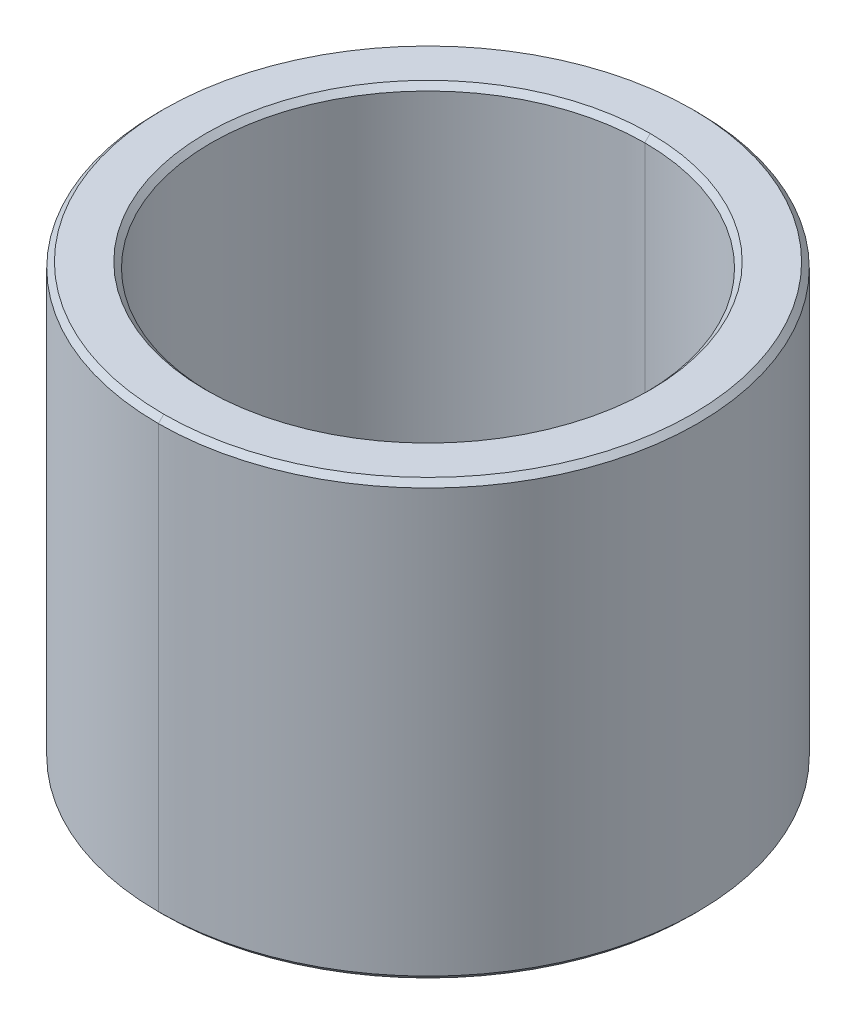
ISO-10303-21;
HEADER;
FILE_DESCRIPTION(('STEP AP214'),'2;1');
FILE_NAME('part.step','',(''),(''),'','','');
FILE_SCHEMA(('AUTOMOTIVE_DESIGN { 1 0 10303 214 1 1 1 1 }'));
ENDSEC;
DATA;
#1=APPLICATION_CONTEXT('core data for automotive mechanical design processes');
#2=APPLICATION_PROTOCOL_DEFINITION('international standard','automotive_design',2000,#1);
#3=PRODUCT_CONTEXT('',#1,'mechanical');
#4=PRODUCT('Part','Part','',(#3));
#5=PRODUCT_RELATED_PRODUCT_CATEGORY('part','',(#4));
#6=PRODUCT_DEFINITION_FORMATION('','',#4);
#7=PRODUCT_DEFINITION_CONTEXT('part definition',#1,'design');
#8=PRODUCT_DEFINITION('design','',#6,#7);
#9=PRODUCT_DEFINITION_SHAPE('','',#8);
#10=(LENGTH_UNIT() NAMED_UNIT(*) SI_UNIT(.MILLI.,.METRE.));
#11=(NAMED_UNIT(*) PLANE_ANGLE_UNIT() SI_UNIT($,.RADIAN.));
#12=(NAMED_UNIT(*) SI_UNIT($,.STERADIAN.) SOLID_ANGLE_UNIT());
#13=UNCERTAINTY_MEASURE_WITH_UNIT(LENGTH_MEASURE(1.E-05),#10,'distance_accuracy_value','');
#14=(GEOMETRIC_REPRESENTATION_CONTEXT(3) GLOBAL_UNCERTAINTY_ASSIGNED_CONTEXT((#13)) GLOBAL_UNIT_ASSIGNED_CONTEXT((#10,
#11,#12)) REPRESENTATION_CONTEXT('',''));
#15=CARTESIAN_POINT('',(0.,0.,0.));
#16=DIRECTION('',(0.,0.,1.));
#17=DIRECTION('',(1.,0.,0.));
#18=AXIS2_PLACEMENT_3D('',#15,#16,#17);
#19=CARTESIAN_POINT('',(0.,3.9,0.));
#20=DIRECTION('',(0.,1.,0.));
#21=DIRECTION('',(0.,0.,1.));
#22=AXIS2_PLACEMENT_3D('',#19,#20,#21);
#23=CONICAL_SURFACE('',#22,4.,0.785398163397448);
#24=DIRECTION('',(0.,0.707106781186548,-0.707106781186548));
#25=VECTOR('',#24,1.);
#26=CARTESIAN_POINT('',(0.,3.9,-4.));
#27=LINE('',#26,#25);
#28=CARTESIAN_POINT('',(0.,3.9,-4.));
#29=VERTEX_POINT('',#28);
#30=CARTESIAN_POINT('',(0.,4.,-4.1));
#31=VERTEX_POINT('',#30);
#32=EDGE_CURVE('E200',#29,#31,#27,.T.);
#33=ORIENTED_EDGE('',*,*,#32,.F.);
#34=CARTESIAN_POINT('',(0.,3.9,0.));
#35=DIRECTION('',(0.,1.,0.));
#36=DIRECTION('',(0.,0.,1.));
#37=AXIS2_PLACEMENT_3D('',#34,#35,#36);
#38=CIRCLE('',#37,4.);
#39=CARTESIAN_POINT('',(0.,3.9,4.));
#40=VERTEX_POINT('',#39);
#41=EDGE_CURVE('E24',#40,#29,#38,.T.);
#42=ORIENTED_EDGE('',*,*,#41,.F.);
#43=DIRECTION('',(0.,0.707106781186548,0.707106781186548));
#44=VECTOR('',#43,1.);
#45=CARTESIAN_POINT('',(0.,3.9,4.));
#46=LINE('',#45,#44);
#47=CARTESIAN_POINT('',(0.,4.,4.1));
#48=VERTEX_POINT('',#47);
#49=EDGE_CURVE('E210',#40,#48,#46,.T.);
#50=ORIENTED_EDGE('',*,*,#49,.T.);
#51=CARTESIAN_POINT('',(0.,4.,0.));
#52=DIRECTION('',(0.,-1.,0.));
#53=DIRECTION('',(0.,0.,1.));
#54=AXIS2_PLACEMENT_3D('',#51,#52,#53);
#55=CIRCLE('',#54,4.1);
#56=EDGE_CURVE('E173',#31,#48,#55,.T.);
#57=ORIENTED_EDGE('',*,*,#56,.F.);
#58=EDGE_LOOP('',(#33,#42,#50,#57));
#59=FACE_BOUND('',#58,.T.);
#60=ADVANCED_FACE('F16',(#59),#23,.F.);
#61=CARTESIAN_POINT('',(0.,-4.,0.));
#62=DIRECTION('',(0.,-1.,0.));
#63=DIRECTION('',(0.,0.,-1.));
#64=AXIS2_PLACEMENT_3D('',#61,#62,#63);
#65=CONICAL_SURFACE('',#64,4.1,0.785398163397448);
#66=DIRECTION('',(0.,-0.707106781186548,0.707106781186548));
#67=VECTOR('',#66,1.);
#68=CARTESIAN_POINT('',(0.,-4.,4.1));
#69=LINE('',#68,#67);
#70=CARTESIAN_POINT('',(0.,-3.9,4.));
#71=VERTEX_POINT('',#70);
#72=CARTESIAN_POINT('',(0.,-4.,4.1));
#73=VERTEX_POINT('',#72);
#74=EDGE_CURVE('E128',#71,#73,#69,.T.);
#75=ORIENTED_EDGE('',*,*,#74,.F.);
#76=CARTESIAN_POINT('',(0.,-3.9,0.));
#77=DIRECTION('',(0.,-1.,0.));
#78=DIRECTION('',(0.,0.,1.));
#79=AXIS2_PLACEMENT_3D('',#76,#77,#78);
#80=CIRCLE('',#79,4.);
#81=CARTESIAN_POINT('',(0.,-3.9,-4.));
#82=VERTEX_POINT('',#81);
#83=EDGE_CURVE('E10',#82,#71,#80,.T.);
#84=ORIENTED_EDGE('',*,*,#83,.F.);
#85=DIRECTION('',(0.,-0.707106781186548,-0.707106781186548));
#86=VECTOR('',#85,1.);
#87=CARTESIAN_POINT('',(0.,-4.,-4.1));
#88=LINE('',#87,#86);
#89=CARTESIAN_POINT('',(0.,-4.,-4.1));
#90=VERTEX_POINT('',#89);
#91=EDGE_CURVE('E118',#82,#90,#88,.T.);
#92=ORIENTED_EDGE('',*,*,#91,.T.);
#93=CARTESIAN_POINT('',(0.,-4.,0.));
#94=DIRECTION('',(0.,1.,0.));
#95=DIRECTION('',(0.,0.,1.));
#96=AXIS2_PLACEMENT_3D('',#93,#94,#95);
#97=CIRCLE('',#96,4.1);
#98=EDGE_CURVE('E104',#73,#90,#97,.T.);
#99=ORIENTED_EDGE('',*,*,#98,.F.);
#100=EDGE_LOOP('',(#75,#84,#92,#99));
#101=FACE_BOUND('',#100,.T.);
#102=ADVANCED_FACE('F119',(#101),#65,.F.);
#103=CARTESIAN_POINT('',(0.,4.,0.));
#104=DIRECTION('',(0.,-1.,0.));
#105=DIRECTION('',(0.,0.,-1.));
#106=AXIS2_PLACEMENT_3D('',#103,#104,#105);
#107=CONICAL_SURFACE('',#106,4.875,0.785398163397462);
#108=DIRECTION('',(0.,-0.707106781186538,0.707106781186557));
#109=VECTOR('',#108,1.);
#110=CARTESIAN_POINT('',(0.,4.,4.875));
#111=LINE('',#110,#109);
#112=CARTESIAN_POINT('',(0.,4.,4.875));
#113=VERTEX_POINT('',#112);
#114=CARTESIAN_POINT('',(0.,3.9,4.975));
#115=VERTEX_POINT('',#114);
#116=EDGE_CURVE('E154',#113,#115,#111,.T.);
#117=ORIENTED_EDGE('',*,*,#116,.F.);
#118=CARTESIAN_POINT('',(0.,4.,0.));
#119=DIRECTION('',(0.,1.,0.));
#120=DIRECTION('',(0.,0.,1.));
#121=AXIS2_PLACEMENT_3D('',#118,#119,#120);
#122=CIRCLE('',#121,4.875);
#123=CARTESIAN_POINT('',(0.,4.,-4.875));
#124=VERTEX_POINT('',#123);
#125=EDGE_CURVE('E170',#124,#113,#122,.T.);
#126=ORIENTED_EDGE('',*,*,#125,.F.);
#127=DIRECTION('',(0.,-0.707106781186538,-0.707106781186557));
#128=VECTOR('',#127,1.);
#129=CARTESIAN_POINT('',(0.,4.,-4.875));
#130=LINE('',#129,#128);
#131=CARTESIAN_POINT('',(0.,3.9,-4.975));
#132=VERTEX_POINT('',#131);
#133=EDGE_CURVE('E150',#124,#132,#130,.T.);
#134=ORIENTED_EDGE('',*,*,#133,.T.);
#135=CARTESIAN_POINT('',(0.,3.9,0.));
#136=DIRECTION('',(0.,-1.,0.));
#137=DIRECTION('',(0.,0.,1.));
#138=AXIS2_PLACEMENT_3D('',#135,#136,#137);
#139=CIRCLE('',#138,4.975);
#140=EDGE_CURVE('E114',#115,#132,#139,.T.);
#141=ORIENTED_EDGE('',*,*,#140,.F.);
#142=EDGE_LOOP('',(#117,#126,#134,#141));
#143=FACE_BOUND('',#142,.T.);
#144=ADVANCED_FACE('F237',(#143),#107,.T.);
#145=CARTESIAN_POINT('',(0.,-3.9,0.));
#146=DIRECTION('',(0.,1.,0.));
#147=DIRECTION('',(0.,0.,1.));
#148=AXIS2_PLACEMENT_3D('',#145,#146,#147);
#149=CONICAL_SURFACE('',#148,4.975,0.785398163397448);
#150=DIRECTION('',(0.,0.707106781186548,-0.707106781186548));
#151=VECTOR('',#150,1.);
#152=CARTESIAN_POINT('',(0.,-3.9,-4.975));
#153=LINE('',#152,#151);
#154=CARTESIAN_POINT('',(0.,-4.,-4.875));
#155=VERTEX_POINT('',#154);
#156=CARTESIAN_POINT('',(0.,-3.9,-4.975));
#157=VERTEX_POINT('',#156);
#158=EDGE_CURVE('E144',#155,#157,#153,.T.);
#159=ORIENTED_EDGE('',*,*,#158,.F.);
#160=CARTESIAN_POINT('',(0.,-4.,0.));
#161=DIRECTION('',(0.,-1.,0.));
#162=DIRECTION('',(0.,0.,1.));
#163=AXIS2_PLACEMENT_3D('',#160,#161,#162);
#164=CIRCLE('',#163,4.875);
#165=CARTESIAN_POINT('',(0.,-4.,4.875));
#166=VERTEX_POINT('',#165);
#167=EDGE_CURVE('E115',#166,#155,#164,.T.);
#168=ORIENTED_EDGE('',*,*,#167,.F.);
#169=DIRECTION('',(0.,0.707106781186548,0.707106781186548));
#170=VECTOR('',#169,1.);
#171=CARTESIAN_POINT('',(0.,-3.9,4.975));
#172=LINE('',#171,#170);
#173=CARTESIAN_POINT('',(0.,-3.9,4.975));
#174=VERTEX_POINT('',#173);
#175=EDGE_CURVE('E143',#166,#174,#172,.T.);
#176=ORIENTED_EDGE('',*,*,#175,.T.);
#177=CARTESIAN_POINT('',(0.,-3.9,0.));
#178=DIRECTION('',(0.,1.,0.));
#179=DIRECTION('',(0.,0.,1.));
#180=AXIS2_PLACEMENT_3D('',#177,#178,#179);
#181=CIRCLE('',#180,4.975);
#182=EDGE_CURVE('E37',#157,#174,#181,.T.);
#183=ORIENTED_EDGE('',*,*,#182,.F.);
#184=EDGE_LOOP('',(#159,#168,#176,#183));
#185=FACE_BOUND('',#184,.T.);
#186=ADVANCED_FACE('F242',(#185),#149,.T.);
#187=CARTESIAN_POINT('',(0.,4.,0.));
#188=DIRECTION('',(0.,-1.,0.));
#189=DIRECTION('',(0.,0.,-1.));
#190=AXIS2_PLACEMENT_3D('',#187,#188,#189);
#191=CYLINDRICAL_SURFACE('',#190,4.);
#192=DIRECTION('',(0.,-1.,0.));
#193=VECTOR('',#192,1.);
#194=CARTESIAN_POINT('',(0.,4.,4.));
#195=LINE('',#194,#193);
#196=EDGE_CURVE('E162',#40,#71,#195,.T.);
#197=ORIENTED_EDGE('',*,*,#196,.F.);
#198=ORIENTED_EDGE('',*,*,#41,.T.);
#199=DIRECTION('',(0.,-1.,0.));
#200=VECTOR('',#199,1.);
#201=CARTESIAN_POINT('',(0.,4.,-4.));
#202=LINE('',#201,#200);
#203=EDGE_CURVE('E166',#29,#82,#202,.T.);
#204=ORIENTED_EDGE('',*,*,#203,.T.);
#205=ORIENTED_EDGE('',*,*,#83,.T.);
#206=EDGE_LOOP('',(#197,#198,#204,#205));
#207=FACE_BOUND('',#206,.T.);
#208=ADVANCED_FACE('F226',(#207),#191,.F.);
#209=CARTESIAN_POINT('',(0.,4.,0.));
#210=DIRECTION('',(0.,-1.,0.));
#211=DIRECTION('',(0.,0.,-1.));
#212=AXIS2_PLACEMENT_3D('',#209,#210,#211);
#213=CYLINDRICAL_SURFACE('',#212,4.975);
#214=DIRECTION('',(0.,-1.,0.));
#215=VECTOR('',#214,1.);
#216=CARTESIAN_POINT('',(0.,4.,4.975));
#217=LINE('',#216,#215);
#218=EDGE_CURVE('E169',#115,#174,#217,.T.);
#219=ORIENTED_EDGE('',*,*,#218,.F.);
#220=ORIENTED_EDGE('',*,*,#140,.T.);
#221=DIRECTION('',(0.,-1.,0.));
#222=VECTOR('',#221,1.);
#223=CARTESIAN_POINT('',(0.,4.,-4.975));
#224=LINE('',#223,#222);
#225=EDGE_CURVE('E174',#132,#157,#224,.T.);
#226=ORIENTED_EDGE('',*,*,#225,.T.);
#227=ORIENTED_EDGE('',*,*,#182,.T.);
#228=EDGE_LOOP('',(#219,#220,#226,#227));
#229=FACE_BOUND('',#228,.T.);
#230=ADVANCED_FACE('F248',(#229),#213,.T.);
#231=CARTESIAN_POINT('',(0.,-4.,0.));
#232=DIRECTION('',(0.,1.,0.));
#233=DIRECTION('',(1.,0.,0.));
#234=AXIS2_PLACEMENT_3D('',#231,#232,#233);
#235=PLANE('',#234);
#236=CARTESIAN_POINT('',(0.,-4.,0.));
#237=DIRECTION('',(0.,1.,0.));
#238=DIRECTION('',(0.,0.,1.));
#239=AXIS2_PLACEMENT_3D('',#236,#237,#238);
#240=CIRCLE('',#239,4.1);
#241=EDGE_CURVE('E109',#90,#73,#240,.T.);
#242=ORIENTED_EDGE('',*,*,#241,.T.);
#243=ORIENTED_EDGE('',*,*,#98,.T.);
#244=EDGE_LOOP('',(#242,#243));
#245=FACE_BOUND('',#244,.T.);
#246=ORIENTED_EDGE('',*,*,#167,.T.);
#247=CARTESIAN_POINT('',(0.,-4.,0.));
#248=DIRECTION('',(0.,-1.,0.));
#249=DIRECTION('',(0.,0.,1.));
#250=AXIS2_PLACEMENT_3D('',#247,#248,#249);
#251=CIRCLE('',#250,4.875);
#252=EDGE_CURVE('E146',#155,#166,#251,.T.);
#253=ORIENTED_EDGE('',*,*,#252,.T.);
#254=EDGE_LOOP('',(#246,#253));
#255=FACE_BOUND('',#254,.T.);
#256=ADVANCED_FACE('F106',(#245,#255),#235,.F.);
#257=CARTESIAN_POINT('',(0.,4.,0.));
#258=DIRECTION('',(0.,1.,0.));
#259=DIRECTION('',(1.,0.,0.));
#260=AXIS2_PLACEMENT_3D('',#257,#258,#259);
#261=PLANE('',#260);
#262=CARTESIAN_POINT('',(0.,4.,0.));
#263=DIRECTION('',(0.,-1.,0.));
#264=DIRECTION('',(0.,0.,1.));
#265=AXIS2_PLACEMENT_3D('',#262,#263,#264);
#266=CIRCLE('',#265,4.1);
#267=EDGE_CURVE('E203',#48,#31,#266,.T.);
#268=ORIENTED_EDGE('',*,*,#267,.T.);
#269=ORIENTED_EDGE('',*,*,#56,.T.);
#270=EDGE_LOOP('',(#268,#269));
#271=FACE_BOUND('',#270,.T.);
#272=ORIENTED_EDGE('',*,*,#125,.T.);
#273=CARTESIAN_POINT('',(0.,4.,0.));
#274=DIRECTION('',(0.,1.,0.));
#275=DIRECTION('',(0.,0.,1.));
#276=AXIS2_PLACEMENT_3D('',#273,#274,#275);
#277=CIRCLE('',#276,4.875);
#278=EDGE_CURVE('E125',#113,#124,#277,.T.);
#279=ORIENTED_EDGE('',*,*,#278,.T.);
#280=EDGE_LOOP('',(#272,#279));
#281=FACE_BOUND('',#280,.T.);
#282=ADVANCED_FACE('F230',(#271,#281),#261,.T.);
#283=CARTESIAN_POINT('',(0.,4.,0.));
#284=DIRECTION('',(0.,-1.,0.));
#285=DIRECTION('',(0.,0.,-1.));
#286=AXIS2_PLACEMENT_3D('',#283,#284,#285);
#287=CYLINDRICAL_SURFACE('',#286,4.975);
#288=CARTESIAN_POINT('',(0.,3.9,0.));
#289=DIRECTION('',(0.,-1.,0.));
#290=DIRECTION('',(0.,0.,1.));
#291=AXIS2_PLACEMENT_3D('',#288,#289,#290);
#292=CIRCLE('',#291,4.975);
#293=EDGE_CURVE('E158',#132,#115,#292,.T.);
#294=ORIENTED_EDGE('',*,*,#293,.T.);
#295=ORIENTED_EDGE('',*,*,#218,.T.);
#296=CARTESIAN_POINT('',(0.,-3.9,0.));
#297=DIRECTION('',(0.,1.,0.));
#298=DIRECTION('',(0.,0.,1.));
#299=AXIS2_PLACEMENT_3D('',#296,#297,#298);
#300=CIRCLE('',#299,4.975);
#301=EDGE_CURVE('E140',#174,#157,#300,.T.);
#302=ORIENTED_EDGE('',*,*,#301,.T.);
#303=ORIENTED_EDGE('',*,*,#225,.F.);
#304=EDGE_LOOP('',(#294,#295,#302,#303));
#305=FACE_BOUND('',#304,.T.);
#306=ADVANCED_FACE('F265',(#305),#287,.T.);
#307=CARTESIAN_POINT('',(0.,4.,0.));
#308=DIRECTION('',(0.,-1.,0.));
#309=DIRECTION('',(0.,0.,-1.));
#310=AXIS2_PLACEMENT_3D('',#307,#308,#309);
#311=CYLINDRICAL_SURFACE('',#310,4.);
#312=CARTESIAN_POINT('',(0.,3.9,0.));
#313=DIRECTION('',(0.,1.,0.));
#314=DIRECTION('',(0.,0.,1.));
#315=AXIS2_PLACEMENT_3D('',#312,#313,#314);
#316=CIRCLE('',#315,4.);
#317=EDGE_CURVE('E198',#29,#40,#316,.T.);
#318=ORIENTED_EDGE('',*,*,#317,.T.);
#319=ORIENTED_EDGE('',*,*,#196,.T.);
#320=CARTESIAN_POINT('',(0.,-3.9,0.));
#321=DIRECTION('',(0.,-1.,0.));
#322=DIRECTION('',(0.,0.,1.));
#323=AXIS2_PLACEMENT_3D('',#320,#321,#322);
#324=CIRCLE('',#323,4.);
#325=EDGE_CURVE('E135',#71,#82,#324,.T.);
#326=ORIENTED_EDGE('',*,*,#325,.T.);
#327=ORIENTED_EDGE('',*,*,#203,.F.);
#328=EDGE_LOOP('',(#318,#319,#326,#327));
#329=FACE_BOUND('',#328,.T.);
#330=ADVANCED_FACE('F223',(#329),#311,.F.);
#331=CARTESIAN_POINT('',(0.,-3.9,0.));
#332=DIRECTION('',(0.,1.,0.));
#333=DIRECTION('',(0.,0.,1.));
#334=AXIS2_PLACEMENT_3D('',#331,#332,#333);
#335=CONICAL_SURFACE('',#334,4.975,0.785398163397448);
#336=ORIENTED_EDGE('',*,*,#252,.F.);
#337=ORIENTED_EDGE('',*,*,#158,.T.);
#338=ORIENTED_EDGE('',*,*,#301,.F.);
#339=ORIENTED_EDGE('',*,*,#175,.F.);
#340=EDGE_LOOP('',(#336,#337,#338,#339));
#341=FACE_BOUND('',#340,.T.);
#342=ADVANCED_FACE('F254',(#341),#335,.T.);
#343=CARTESIAN_POINT('',(0.,4.,0.));
#344=DIRECTION('',(0.,-1.,0.));
#345=DIRECTION('',(0.,0.,-1.));
#346=AXIS2_PLACEMENT_3D('',#343,#344,#345);
#347=CONICAL_SURFACE('',#346,4.875,0.785398163397462);
#348=ORIENTED_EDGE('',*,*,#278,.F.);
#349=ORIENTED_EDGE('',*,*,#116,.T.);
#350=ORIENTED_EDGE('',*,*,#293,.F.);
#351=ORIENTED_EDGE('',*,*,#133,.F.);
#352=EDGE_LOOP('',(#348,#349,#350,#351));
#353=FACE_BOUND('',#352,.T.);
#354=ADVANCED_FACE('F251',(#353),#347,.T.);
#355=CARTESIAN_POINT('',(0.,-4.,0.));
#356=DIRECTION('',(0.,-1.,0.));
#357=DIRECTION('',(0.,0.,-1.));
#358=AXIS2_PLACEMENT_3D('',#355,#356,#357);
#359=CONICAL_SURFACE('',#358,4.1,0.785398163397448);
#360=ORIENTED_EDGE('',*,*,#325,.F.);
#361=ORIENTED_EDGE('',*,*,#74,.T.);
#362=ORIENTED_EDGE('',*,*,#241,.F.);
#363=ORIENTED_EDGE('',*,*,#91,.F.);
#364=EDGE_LOOP('',(#360,#361,#362,#363));
#365=FACE_BOUND('',#364,.T.);
#366=ADVANCED_FACE('F127',(#365),#359,.F.);
#367=CARTESIAN_POINT('',(0.,3.9,0.));
#368=DIRECTION('',(0.,1.,0.));
#369=DIRECTION('',(0.,0.,1.));
#370=AXIS2_PLACEMENT_3D('',#367,#368,#369);
#371=CONICAL_SURFACE('',#370,4.,0.785398163397448);
#372=ORIENTED_EDGE('',*,*,#317,.F.);
#373=ORIENTED_EDGE('',*,*,#32,.T.);
#374=ORIENTED_EDGE('',*,*,#267,.F.);
#375=ORIENTED_EDGE('',*,*,#49,.F.);
#376=EDGE_LOOP('',(#372,#373,#374,#375));
#377=FACE_BOUND('',#376,.T.);
#378=ADVANCED_FACE('F228',(#377),#371,.F.);
#379=CLOSED_SHELL('',(#60,#102,#144,#186,#208,#230,#256,#282,#306,#330,#342,#354,#366,#378));
#380=MANIFOLD_SOLID_BREP('B1',#379);
#381=ADVANCED_BREP_SHAPE_REPRESENTATION('',(#18,#380),#14);
#382=SHAPE_DEFINITION_REPRESENTATION(#9,#381);
ENDSEC;
END-ISO-10303-21;
